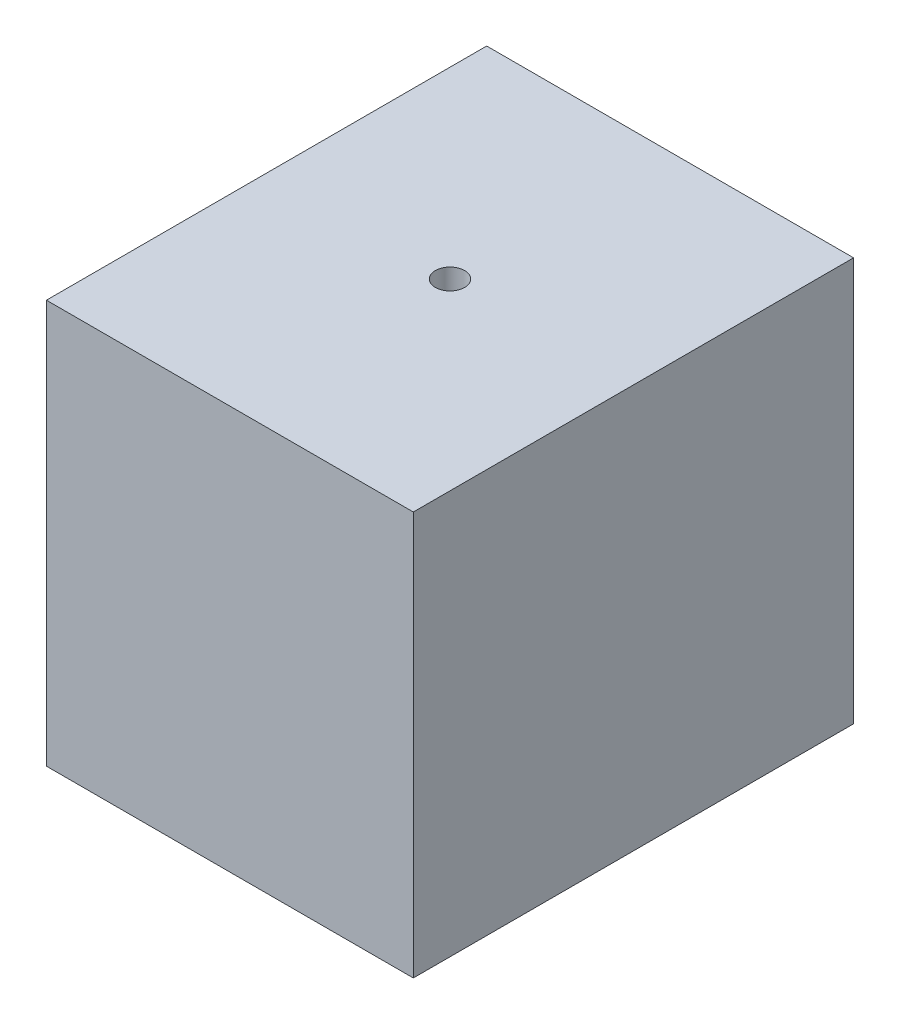
ISO-10303-21;
HEADER;
FILE_DESCRIPTION(('STEP AP214'),'2;1');
FILE_NAME('part.step','',(''),(''),'','','');
FILE_SCHEMA(('AUTOMOTIVE_DESIGN { 1 0 10303 214 1 1 1 1 }'));
ENDSEC;
DATA;
#1=APPLICATION_CONTEXT('core data for automotive mechanical design processes');
#2=APPLICATION_PROTOCOL_DEFINITION('international standard','automotive_design',2000,#1);
#3=PRODUCT_CONTEXT('',#1,'mechanical');
#4=PRODUCT('Part','Part','',(#3));
#5=PRODUCT_RELATED_PRODUCT_CATEGORY('part','',(#4));
#6=PRODUCT_DEFINITION_FORMATION('','',#4);
#7=PRODUCT_DEFINITION_CONTEXT('part definition',#1,'design');
#8=PRODUCT_DEFINITION('design','',#6,#7);
#9=PRODUCT_DEFINITION_SHAPE('','',#8);
#10=(LENGTH_UNIT() NAMED_UNIT(*) SI_UNIT(.MILLI.,.METRE.));
#11=(NAMED_UNIT(*) PLANE_ANGLE_UNIT() SI_UNIT($,.RADIAN.));
#12=(NAMED_UNIT(*) SI_UNIT($,.STERADIAN.) SOLID_ANGLE_UNIT());
#13=UNCERTAINTY_MEASURE_WITH_UNIT(LENGTH_MEASURE(1.E-05),#10,'distance_accuracy_value','');
#14=(GEOMETRIC_REPRESENTATION_CONTEXT(3) GLOBAL_UNCERTAINTY_ASSIGNED_CONTEXT((#13)) GLOBAL_UNIT_ASSIGNED_CONTEXT((#10,
#11,#12)) REPRESENTATION_CONTEXT('',''));
#15=CARTESIAN_POINT('',(0.,0.,0.));
#16=DIRECTION('',(0.,0.,1.));
#17=DIRECTION('',(1.,0.,0.));
#18=AXIS2_PLACEMENT_3D('',#15,#16,#17);
#19=CARTESIAN_POINT('',(0.,0.,-30.));
#20=DIRECTION('',(0.,0.,1.));
#21=DIRECTION('',(1.,0.,0.));
#22=AXIS2_PLACEMENT_3D('',#19,#20,#21);
#23=PLANE('',#22);
#24=DIRECTION('',(0.,1.,0.));
#25=VECTOR('',#24,1.);
#26=CARTESIAN_POINT('',(25.,27.5,-30.));
#27=LINE('',#26,#25);
#28=CARTESIAN_POINT('',(25.,-27.5,-30.));
#29=VERTEX_POINT('',#28);
#30=CARTESIAN_POINT('',(25.,27.5,-30.));
#31=VERTEX_POINT('',#30);
#32=EDGE_CURVE('E112',#29,#31,#27,.T.);
#33=ORIENTED_EDGE('',*,*,#32,.F.);
#34=DIRECTION('',(1.,0.,0.));
#35=VECTOR('',#34,1.);
#36=CARTESIAN_POINT('',(-25.,-27.5,-30.));
#37=LINE('',#36,#35);
#38=CARTESIAN_POINT('',(-25.,-27.5,-30.));
#39=VERTEX_POINT('',#38);
#40=EDGE_CURVE('E78',#39,#29,#37,.T.);
#41=ORIENTED_EDGE('',*,*,#40,.F.);
#42=DIRECTION('',(0.,-1.,0.));
#43=VECTOR('',#42,1.);
#44=CARTESIAN_POINT('',(-25.,27.5,-30.));
#45=LINE('',#44,#43);
#46=CARTESIAN_POINT('',(-25.,27.5,-30.));
#47=VERTEX_POINT('',#46);
#48=EDGE_CURVE('E128',#47,#39,#45,.T.);
#49=ORIENTED_EDGE('',*,*,#48,.F.);
#50=DIRECTION('',(-1.,0.,0.));
#51=VECTOR('',#50,1.);
#52=CARTESIAN_POINT('',(-25.,27.5,-30.));
#53=LINE('',#52,#51);
#54=EDGE_CURVE('E115',#31,#47,#53,.T.);
#55=ORIENTED_EDGE('',*,*,#54,.F.);
#56=EDGE_LOOP('',(#33,#41,#49,#55));
#57=FACE_BOUND('',#56,.T.);
#58=CARTESIAN_POINT('',(0.,0.,-30.));
#59=DIRECTION('',(0.,0.,-1.));
#60=DIRECTION('',(-1.,0.,0.));
#61=AXIS2_PLACEMENT_3D('',#58,#59,#60);
#62=CIRCLE('',#61,15.);
#63=CARTESIAN_POINT('',(11.180339887499,10.,-30.));
#64=VERTEX_POINT('',#63);
#65=CARTESIAN_POINT('',(-11.180339887499,10.,-30.));
#66=VERTEX_POINT('',#65);
#67=EDGE_CURVE('E111',#64,#66,#62,.T.);
#68=ORIENTED_EDGE('',*,*,#67,.F.);
#69=DIRECTION('',(1.,0.,0.));
#70=VECTOR('',#69,1.);
#71=CARTESIAN_POINT('',(-11.180339887499,10.,-30.));
#72=LINE('',#71,#70);
#73=EDGE_CURVE('E48',#66,#64,#72,.T.);
#74=ORIENTED_EDGE('',*,*,#73,.F.);
#75=EDGE_LOOP('',(#68,#74));
#76=FACE_BOUND('',#75,.T.);
#77=ADVANCED_FACE('F34',(#57,#76),#23,.F.);
#78=CARTESIAN_POINT('',(25.,27.5,30.));
#79=DIRECTION('',(-1.,0.,0.));
#80=DIRECTION('',(0.,-1.,0.));
#81=AXIS2_PLACEMENT_3D('',#78,#79,#80);
#82=PLANE('',#81);
#83=ORIENTED_EDGE('',*,*,#32,.T.);
#84=DIRECTION('',(0.,0.,-1.));
#85=VECTOR('',#84,1.);
#86=CARTESIAN_POINT('',(25.,27.5,30.));
#87=LINE('',#86,#85);
#88=CARTESIAN_POINT('',(25.,27.5,30.));
#89=VERTEX_POINT('',#88);
#90=EDGE_CURVE('E11',#89,#31,#87,.T.);
#91=ORIENTED_EDGE('',*,*,#90,.F.);
#92=DIRECTION('',(0.,1.,0.));
#93=VECTOR('',#92,1.);
#94=CARTESIAN_POINT('',(25.,27.5,30.));
#95=LINE('',#94,#93);
#96=CARTESIAN_POINT('',(25.,-27.5,30.));
#97=VERTEX_POINT('',#96);
#98=EDGE_CURVE('E120',#97,#89,#95,.T.);
#99=ORIENTED_EDGE('',*,*,#98,.F.);
#100=DIRECTION('',(0.,0.,-1.));
#101=VECTOR('',#100,1.);
#102=CARTESIAN_POINT('',(25.,-27.5,30.));
#103=LINE('',#102,#101);
#104=EDGE_CURVE('E125',#97,#29,#103,.T.);
#105=ORIENTED_EDGE('',*,*,#104,.T.);
#106=EDGE_LOOP('',(#83,#91,#99,#105));
#107=FACE_BOUND('',#106,.T.);
#108=ADVANCED_FACE('F36',(#107),#82,.F.);
#109=CARTESIAN_POINT('',(-25.,27.5,30.));
#110=DIRECTION('',(0.,-1.,0.));
#111=DIRECTION('',(0.,0.,-1.));
#112=AXIS2_PLACEMENT_3D('',#109,#110,#111);
#113=PLANE('',#112);
#114=CARTESIAN_POINT('',(0.,27.5,0.));
#115=DIRECTION('',(0.,1.,0.));
#116=DIRECTION('',(0.,0.,1.));
#117=AXIS2_PLACEMENT_3D('',#114,#115,#116);
#118=CIRCLE('',#117,2.);
#119=CARTESIAN_POINT('',(0.,27.5,2.));
#120=VERTEX_POINT('',#119);
#121=EDGE_CURVE('E179',#120,#120,#118,.T.);
#122=ORIENTED_EDGE('',*,*,#121,.F.);
#123=EDGE_LOOP('',(#122));
#124=FACE_BOUND('',#123,.T.);
#125=ORIENTED_EDGE('',*,*,#54,.T.);
#126=DIRECTION('',(0.,0.,-1.));
#127=VECTOR('',#126,1.);
#128=CARTESIAN_POINT('',(-25.,27.5,30.));
#129=LINE('',#128,#127);
#130=CARTESIAN_POINT('',(-25.,27.5,30.));
#131=VERTEX_POINT('',#130);
#132=EDGE_CURVE('E42',#131,#47,#129,.T.);
#133=ORIENTED_EDGE('',*,*,#132,.F.);
#134=DIRECTION('',(-1.,0.,0.));
#135=VECTOR('',#134,1.);
#136=CARTESIAN_POINT('',(-25.,27.5,30.));
#137=LINE('',#136,#135);
#138=EDGE_CURVE('E85',#89,#131,#137,.T.);
#139=ORIENTED_EDGE('',*,*,#138,.F.);
#140=ORIENTED_EDGE('',*,*,#90,.T.);
#141=EDGE_LOOP('',(#125,#133,#139,#140));
#142=FACE_BOUND('',#141,.T.);
#143=ADVANCED_FACE('F153',(#124,#142),#113,.F.);
#144=CARTESIAN_POINT('',(-25.,27.5,30.));
#145=DIRECTION('',(1.,0.,0.));
#146=DIRECTION('',(0.,1.,0.));
#147=AXIS2_PLACEMENT_3D('',#144,#145,#146);
#148=PLANE('',#147);
#149=ORIENTED_EDGE('',*,*,#48,.T.);
#150=DIRECTION('',(0.,0.,-1.));
#151=VECTOR('',#150,1.);
#152=CARTESIAN_POINT('',(-25.,-27.5,30.));
#153=LINE('',#152,#151);
#154=CARTESIAN_POINT('',(-25.,-27.5,30.));
#155=VERTEX_POINT('',#154);
#156=EDGE_CURVE('E132',#155,#39,#153,.T.);
#157=ORIENTED_EDGE('',*,*,#156,.F.);
#158=DIRECTION('',(0.,-1.,0.));
#159=VECTOR('',#158,1.);
#160=CARTESIAN_POINT('',(-25.,27.5,30.));
#161=LINE('',#160,#159);
#162=EDGE_CURVE('E123',#131,#155,#161,.T.);
#163=ORIENTED_EDGE('',*,*,#162,.F.);
#164=ORIENTED_EDGE('',*,*,#132,.T.);
#165=EDGE_LOOP('',(#149,#157,#163,#164));
#166=FACE_BOUND('',#165,.T.);
#167=ADVANCED_FACE('F137',(#166),#148,.F.);
#168=CARTESIAN_POINT('',(-25.,-27.5,30.));
#169=DIRECTION('',(0.,1.,0.));
#170=DIRECTION('',(0.,0.,1.));
#171=AXIS2_PLACEMENT_3D('',#168,#169,#170);
#172=PLANE('',#171);
#173=ORIENTED_EDGE('',*,*,#40,.T.);
#174=ORIENTED_EDGE('',*,*,#104,.F.);
#175=DIRECTION('',(1.,0.,0.));
#176=VECTOR('',#175,1.);
#177=CARTESIAN_POINT('',(-25.,-27.5,30.));
#178=LINE('',#177,#176);
#179=EDGE_CURVE('E57',#155,#97,#178,.T.);
#180=ORIENTED_EDGE('',*,*,#179,.F.);
#181=ORIENTED_EDGE('',*,*,#156,.T.);
#182=EDGE_LOOP('',(#173,#174,#180,#181));
#183=FACE_BOUND('',#182,.T.);
#184=ADVANCED_FACE('F144',(#183),#172,.F.);
#185=CARTESIAN_POINT('',(0.,0.,30.));
#186=DIRECTION('',(0.,0.,1.));
#187=DIRECTION('',(1.,0.,0.));
#188=AXIS2_PLACEMENT_3D('',#185,#186,#187);
#189=PLANE('',#188);
#190=ORIENTED_EDGE('',*,*,#98,.T.);
#191=ORIENTED_EDGE('',*,*,#138,.T.);
#192=ORIENTED_EDGE('',*,*,#162,.T.);
#193=ORIENTED_EDGE('',*,*,#179,.T.);
#194=EDGE_LOOP('',(#190,#191,#192,#193));
#195=FACE_BOUND('',#194,.T.);
#196=ADVANCED_FACE('F146',(#195),#189,.T.);
#197=CARTESIAN_POINT('',(0.,0.,-40.));
#198=DIRECTION('',(0.,0.,1.));
#199=DIRECTION('',(1.,0.,0.));
#200=AXIS2_PLACEMENT_3D('',#197,#198,#199);
#201=CYLINDRICAL_SURFACE('',#200,15.);
#202=ORIENTED_EDGE('',*,*,#67,.T.);
#203=DIRECTION('',(0.,0.,1.));
#204=VECTOR('',#203,1.);
#205=CARTESIAN_POINT('',(-11.180339887499,10.,-40.));
#206=LINE('',#205,#204);
#207=CARTESIAN_POINT('',(-11.180339887499,10.,-40.));
#208=VERTEX_POINT('',#207);
#209=EDGE_CURVE('E99',#208,#66,#206,.T.);
#210=ORIENTED_EDGE('',*,*,#209,.F.);
#211=CARTESIAN_POINT('',(0.,0.,-40.));
#212=DIRECTION('',(0.,0.,-1.));
#213=DIRECTION('',(-1.,0.,0.));
#214=AXIS2_PLACEMENT_3D('',#211,#212,#213);
#215=CIRCLE('',#214,15.);
#216=CARTESIAN_POINT('',(11.180339887499,10.,-40.));
#217=VERTEX_POINT('',#216);
#218=EDGE_CURVE('E105',#217,#208,#215,.T.);
#219=ORIENTED_EDGE('',*,*,#218,.F.);
#220=DIRECTION('',(0.,0.,1.));
#221=VECTOR('',#220,1.);
#222=CARTESIAN_POINT('',(11.180339887499,10.,-40.));
#223=LINE('',#222,#221);
#224=EDGE_CURVE('E102',#217,#64,#223,.T.);
#225=ORIENTED_EDGE('',*,*,#224,.T.);
#226=EDGE_LOOP('',(#202,#210,#219,#225));
#227=FACE_BOUND('',#226,.T.);
#228=ADVANCED_FACE('F110',(#227),#201,.T.);
#229=CARTESIAN_POINT('',(-11.180339887499,10.,-40.));
#230=DIRECTION('',(0.,-1.,0.));
#231=DIRECTION('',(0.,0.,-1.));
#232=AXIS2_PLACEMENT_3D('',#229,#230,#231);
#233=PLANE('',#232);
#234=ORIENTED_EDGE('',*,*,#73,.T.);
#235=ORIENTED_EDGE('',*,*,#224,.F.);
#236=DIRECTION('',(1.,0.,0.));
#237=VECTOR('',#236,1.);
#238=CARTESIAN_POINT('',(-11.180339887499,10.,-40.));
#239=LINE('',#238,#237);
#240=EDGE_CURVE('E95',#208,#217,#239,.T.);
#241=ORIENTED_EDGE('',*,*,#240,.F.);
#242=ORIENTED_EDGE('',*,*,#209,.T.);
#243=EDGE_LOOP('',(#234,#235,#241,#242));
#244=FACE_BOUND('',#243,.T.);
#245=ADVANCED_FACE('F97',(#244),#233,.F.);
#246=CARTESIAN_POINT('',(0.,0.,-40.));
#247=DIRECTION('',(0.,0.,-1.));
#248=DIRECTION('',(-1.,0.,0.));
#249=AXIS2_PLACEMENT_3D('',#246,#247,#248);
#250=PLANE('',#249);
#251=ORIENTED_EDGE('',*,*,#218,.T.);
#252=ORIENTED_EDGE('',*,*,#240,.T.);
#253=EDGE_LOOP('',(#251,#252));
#254=FACE_BOUND('',#253,.T.);
#255=ADVANCED_FACE('F107',(#254),#250,.T.);
#256=CARTESIAN_POINT('',(0.,17.5,0.));
#257=DIRECTION('',(0.,1.,0.));
#258=DIRECTION('',(0.,0.,1.));
#259=AXIS2_PLACEMENT_3D('',#256,#257,#258);
#260=CYLINDRICAL_SURFACE('',#259,2.);
#261=CARTESIAN_POINT('',(0.,17.5,0.));
#262=DIRECTION('',(0.,1.,0.));
#263=DIRECTION('',(0.,0.,1.));
#264=AXIS2_PLACEMENT_3D('',#261,#262,#263);
#265=CIRCLE('',#264,2.);
#266=CARTESIAN_POINT('',(0.,17.5,2.));
#267=VERTEX_POINT('',#266);
#268=EDGE_CURVE('E178',#267,#267,#265,.T.);
#269=ORIENTED_EDGE('',*,*,#268,.F.);
#270=EDGE_LOOP('',(#269));
#271=FACE_BOUND('',#270,.T.);
#272=ORIENTED_EDGE('',*,*,#121,.T.);
#273=EDGE_LOOP('',(#272));
#274=FACE_BOUND('',#273,.T.);
#275=ADVANCED_FACE('F167',(#271,#274),#260,.F.);
#276=CARTESIAN_POINT('',(0.,17.5,0.));
#277=DIRECTION('',(0.,1.,0.));
#278=DIRECTION('',(0.,0.,1.));
#279=AXIS2_PLACEMENT_3D('',#276,#277,#278);
#280=PLANE('',#279);
#281=ORIENTED_EDGE('',*,*,#268,.T.);
#282=EDGE_LOOP('',(#281));
#283=FACE_BOUND('',#282,.T.);
#284=ADVANCED_FACE('F170',(#283),#280,.T.);
#285=CLOSED_SHELL('',(#77,#108,#143,#167,#184,#196,#228,#245,#255,#275,#284));
#286=MANIFOLD_SOLID_BREP('B2',#285);
#287=ADVANCED_BREP_SHAPE_REPRESENTATION('',(#18,#286),#14);
#288=SHAPE_DEFINITION_REPRESENTATION(#9,#287);
ENDSEC;
END-ISO-10303-21;
